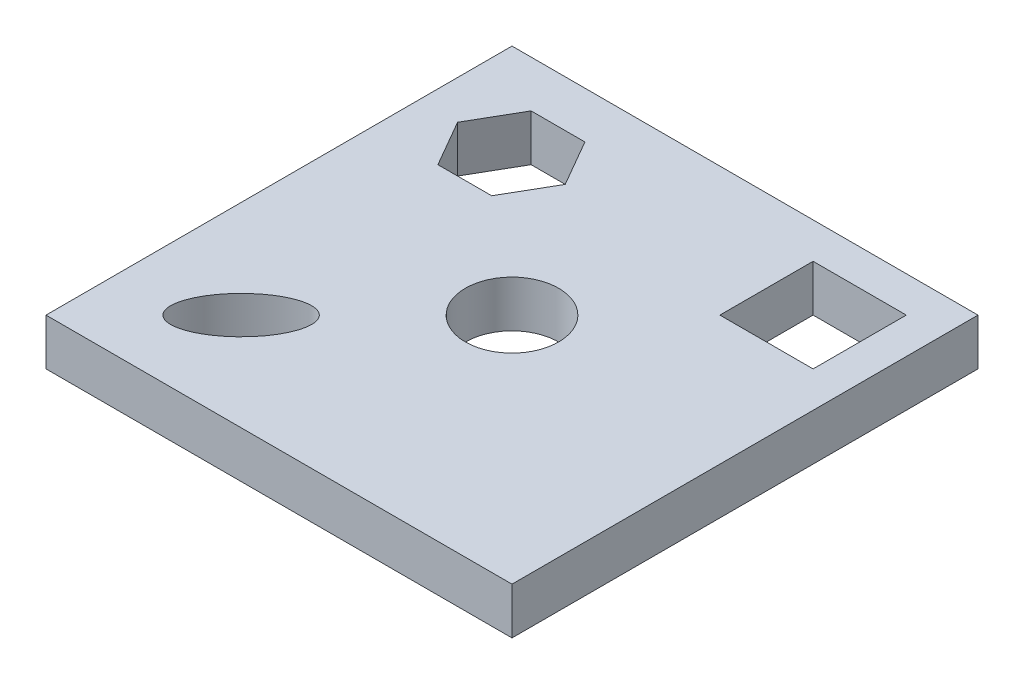
ISO-10303-21;
HEADER;
FILE_DESCRIPTION(('STEP AP214'),'2;1');
FILE_NAME('part.step','',(''),(''),'','','');
FILE_SCHEMA(('AUTOMOTIVE_DESIGN { 1 0 10303 214 1 1 1 1 }'));
ENDSEC;
DATA;
#1=APPLICATION_CONTEXT('core data for automotive mechanical design processes');
#2=APPLICATION_PROTOCOL_DEFINITION('international standard','automotive_design',2000,#1);
#3=PRODUCT_CONTEXT('',#1,'mechanical');
#4=PRODUCT('Part','Part','',(#3));
#5=PRODUCT_RELATED_PRODUCT_CATEGORY('part','',(#4));
#6=PRODUCT_DEFINITION_FORMATION('','',#4);
#7=PRODUCT_DEFINITION_CONTEXT('part definition',#1,'design');
#8=PRODUCT_DEFINITION('design','',#6,#7);
#9=PRODUCT_DEFINITION_SHAPE('','',#8);
#10=(LENGTH_UNIT() NAMED_UNIT(*) SI_UNIT(.MILLI.,.METRE.));
#11=(NAMED_UNIT(*) PLANE_ANGLE_UNIT() SI_UNIT($,.RADIAN.));
#12=(NAMED_UNIT(*) SI_UNIT($,.STERADIAN.) SOLID_ANGLE_UNIT());
#13=UNCERTAINTY_MEASURE_WITH_UNIT(LENGTH_MEASURE(1.E-05),#10,'distance_accuracy_value','');
#14=(GEOMETRIC_REPRESENTATION_CONTEXT(3) GLOBAL_UNCERTAINTY_ASSIGNED_CONTEXT((#13)) GLOBAL_UNIT_ASSIGNED_CONTEXT((#10,
#11,#12)) REPRESENTATION_CONTEXT('',''));
#15=CARTESIAN_POINT('',(0.,0.,0.));
#16=DIRECTION('',(0.,0.,1.));
#17=DIRECTION('',(1.,0.,0.));
#18=AXIS2_PLACEMENT_3D('',#15,#16,#17);
#19=CARTESIAN_POINT('',(0.,10.,0.));
#20=DIRECTION('',(0.,-1.,0.));
#21=DIRECTION('',(0.,0.,-1.));
#22=AXIS2_PLACEMENT_3D('',#19,#20,#21);
#23=PLANE('',#22);
#24=DIRECTION('',(0.499999999999999,0.,-0.866025403784439));
#25=VECTOR('',#24,1.);
#26=CARTESIAN_POINT('',(-24.3550675771164,10.,-20.));
#27=LINE('',#26,#25);
#28=CARTESIAN_POINT('',(-24.3550675771164,10.,-20.));
#29=VERTEX_POINT('',#28);
#30=CARTESIAN_POINT('',(-18.5815648852202,10.,-30.));
#31=VERTEX_POINT('',#30);
#32=EDGE_CURVE('E192',#29,#31,#27,.T.);
#33=ORIENTED_EDGE('',*,*,#32,.F.);
#34=DIRECTION('',(1.,0.,0.));
#35=VECTOR('',#34,1.);
#36=CARTESIAN_POINT('',(-35.9020729609089,10.,-20.));
#37=LINE('',#36,#35);
#38=CARTESIAN_POINT('',(-35.9020729609089,10.,-20.));
#39=VERTEX_POINT('',#38);
#40=EDGE_CURVE('E209',#39,#29,#37,.T.);
#41=ORIENTED_EDGE('',*,*,#40,.F.);
#42=DIRECTION('',(0.5,0.,0.866025403784438));
#43=VECTOR('',#42,1.);
#44=CARTESIAN_POINT('',(-41.6755756528052,10.,-30.));
#45=LINE('',#44,#43);
#46=CARTESIAN_POINT('',(-41.6755756528052,10.,-30.));
#47=VERTEX_POINT('',#46);
#48=EDGE_CURVE('E205',#47,#39,#45,.T.);
#49=ORIENTED_EDGE('',*,*,#48,.F.);
#50=DIRECTION('',(-0.5,0.,0.866025403784439));
#51=VECTOR('',#50,1.);
#52=CARTESIAN_POINT('',(-35.9020729609089,10.,-40.));
#53=LINE('',#52,#51);
#54=CARTESIAN_POINT('',(-35.9020729609089,10.,-40.));
#55=VERTEX_POINT('',#54);
#56=EDGE_CURVE('E202',#55,#47,#53,.T.);
#57=ORIENTED_EDGE('',*,*,#56,.F.);
#58=DIRECTION('',(-1.,0.,0.));
#59=VECTOR('',#58,1.);
#60=CARTESIAN_POINT('',(-24.3550675771164,10.,-40.));
#61=LINE('',#60,#59);
#62=CARTESIAN_POINT('',(-24.3550675771164,10.,-40.));
#63=VERTEX_POINT('',#62);
#64=EDGE_CURVE('E199',#63,#55,#61,.T.);
#65=ORIENTED_EDGE('',*,*,#64,.F.);
#66=DIRECTION('',(-0.5,0.,-0.866025403784438));
#67=VECTOR('',#66,1.);
#68=CARTESIAN_POINT('',(-18.5815648852202,10.,-30.));
#69=LINE('',#68,#67);
#70=EDGE_CURVE('E195',#31,#63,#69,.T.);
#71=ORIENTED_EDGE('',*,*,#70,.F.);
#72=EDGE_LOOP('',(#33,#41,#49,#57,#65,#71));
#73=FACE_BOUND('',#72,.T.);
#74=DIRECTION('',(0.,0.,-1.));
#75=VECTOR('',#74,1.);
#76=CARTESIAN_POINT('',(50.,10.,50.));
#77=LINE('',#76,#75);
#78=CARTESIAN_POINT('',(50.,10.,50.));
#79=VERTEX_POINT('',#78);
#80=CARTESIAN_POINT('',(50.,10.,-50.));
#81=VERTEX_POINT('',#80);
#82=EDGE_CURVE('E263',#79,#81,#77,.T.);
#83=ORIENTED_EDGE('',*,*,#82,.T.);
#84=DIRECTION('',(-1.,0.,0.));
#85=VECTOR('',#84,1.);
#86=CARTESIAN_POINT('',(-50.,10.,-50.));
#87=LINE('',#86,#85);
#88=CARTESIAN_POINT('',(-50.,10.,-50.));
#89=VERTEX_POINT('',#88);
#90=EDGE_CURVE('E267',#81,#89,#87,.T.);
#91=ORIENTED_EDGE('',*,*,#90,.T.);
#92=DIRECTION('',(0.,0.,1.));
#93=VECTOR('',#92,1.);
#94=CARTESIAN_POINT('',(-50.,10.,50.));
#95=LINE('',#94,#93);
#96=CARTESIAN_POINT('',(-50.,10.,50.));
#97=VERTEX_POINT('',#96);
#98=EDGE_CURVE('E271',#89,#97,#95,.T.);
#99=ORIENTED_EDGE('',*,*,#98,.T.);
#100=DIRECTION('',(1.,0.,0.));
#101=VECTOR('',#100,1.);
#102=CARTESIAN_POINT('',(-50.,10.,50.));
#103=LINE('',#102,#101);
#104=EDGE_CURVE('E274',#97,#79,#103,.T.);
#105=ORIENTED_EDGE('',*,*,#104,.T.);
#106=EDGE_LOOP('',(#83,#91,#99,#105));
#107=FACE_BOUND('',#106,.T.);
#108=CARTESIAN_POINT('',(0.,10.,0.));
#109=DIRECTION('',(0.,1.,0.));
#110=DIRECTION('',(0.,0.,1.));
#111=AXIS2_PLACEMENT_3D('',#108,#109,#110);
#112=CIRCLE('',#111,10.);
#113=CARTESIAN_POINT('',(0.,10.,10.));
#114=VERTEX_POINT('',#113);
#115=EDGE_CURVE('E255',#114,#114,#112,.T.);
#116=ORIENTED_EDGE('',*,*,#115,.F.);
#117=EDGE_LOOP('',(#116));
#118=FACE_BOUND('',#117,.T.);
#119=DIRECTION('',(0.,0.,-1.));
#120=VECTOR('',#119,1.);
#121=CARTESIAN_POINT('',(42.3058304418091,10.,-22.3058304418091));
#122=LINE('',#121,#120);
#123=CARTESIAN_POINT('',(42.3058304418091,10.,-22.3058304418091));
#124=VERTEX_POINT('',#123);
#125=CARTESIAN_POINT('',(42.3058304418091,10.,-42.3058304418091));
#126=VERTEX_POINT('',#125);
#127=EDGE_CURVE('E141',#124,#126,#122,.T.);
#128=ORIENTED_EDGE('',*,*,#127,.F.);
#129=DIRECTION('',(1.,0.,0.));
#130=VECTOR('',#129,1.);
#131=CARTESIAN_POINT('',(22.3058304418091,10.,-22.3058304418091));
#132=LINE('',#131,#130);
#133=CARTESIAN_POINT('',(22.3058304418091,10.,-22.3058304418091));
#134=VERTEX_POINT('',#133);
#135=EDGE_CURVE('E168',#134,#124,#132,.T.);
#136=ORIENTED_EDGE('',*,*,#135,.F.);
#137=DIRECTION('',(0.,0.,1.));
#138=VECTOR('',#137,1.);
#139=CARTESIAN_POINT('',(22.3058304418091,10.,-22.3058304418091));
#140=LINE('',#139,#138);
#141=CARTESIAN_POINT('',(22.3058304418091,10.,-42.3058304418091));
#142=VERTEX_POINT('',#141);
#143=EDGE_CURVE('E164',#142,#134,#140,.T.);
#144=ORIENTED_EDGE('',*,*,#143,.F.);
#145=DIRECTION('',(-1.,0.,0.));
#146=VECTOR('',#145,1.);
#147=CARTESIAN_POINT('',(22.3058304418091,10.,-42.3058304418091));
#148=LINE('',#147,#146);
#149=EDGE_CURVE('E150',#126,#142,#148,.T.);
#150=ORIENTED_EDGE('',*,*,#149,.F.);
#151=EDGE_LOOP('',(#128,#136,#144,#150));
#152=FACE_BOUND('',#151,.T.);
#153=CARTESIAN_POINT('',(-29.0650781796229,10.,29.065078179623));
#154=DIRECTION('',(0.,1.,0.));
#155=DIRECTION('',(0.707106781186548,0.,-0.707106781186547));
#156=AXIS2_PLACEMENT_3D('',#153,#154,#155);
#157=ELLIPSE('',#156,11.8671123244267,5.71715280038178);
#158=CARTESIAN_POINT('',(-20.6737625819184,10.,20.6737625819184));
#159=VERTEX_POINT('',#158);
#160=EDGE_CURVE('E176',#159,#159,#157,.T.);
#161=ORIENTED_EDGE('',*,*,#160,.F.);
#162=EDGE_LOOP('',(#161));
#163=FACE_BOUND('',#162,.T.);
#164=ADVANCED_FACE('F39',(#73,#107,#118,#152,#163),#23,.F.);
#165=CARTESIAN_POINT('',(0.,0.,0.));
#166=DIRECTION('',(0.,-1.,0.));
#167=DIRECTION('',(0.,0.,-1.));
#168=AXIS2_PLACEMENT_3D('',#165,#166,#167);
#169=PLANE('',#168);
#170=DIRECTION('',(1.,0.,0.));
#171=VECTOR('',#170,1.);
#172=CARTESIAN_POINT('',(22.3058304418091,0.,-22.3058304418091));
#173=LINE('',#172,#171);
#174=CARTESIAN_POINT('',(22.3058304418091,0.,-22.3058304418091));
#175=VERTEX_POINT('',#174);
#176=CARTESIAN_POINT('',(42.3058304418091,0.,-22.3058304418091));
#177=VERTEX_POINT('',#176);
#178=EDGE_CURVE('E151',#175,#177,#173,.T.);
#179=ORIENTED_EDGE('',*,*,#178,.T.);
#180=DIRECTION('',(0.,0.,-1.));
#181=VECTOR('',#180,1.);
#182=CARTESIAN_POINT('',(42.3058304418091,0.,-22.3058304418091));
#183=LINE('',#182,#181);
#184=CARTESIAN_POINT('',(42.3058304418091,0.,-42.3058304418091));
#185=VERTEX_POINT('',#184);
#186=EDGE_CURVE('E63',#177,#185,#183,.T.);
#187=ORIENTED_EDGE('',*,*,#186,.T.);
#188=DIRECTION('',(-1.,0.,0.));
#189=VECTOR('',#188,1.);
#190=CARTESIAN_POINT('',(22.3058304418091,0.,-42.3058304418091));
#191=LINE('',#190,#189);
#192=CARTESIAN_POINT('',(22.3058304418091,0.,-42.3058304418091));
#193=VERTEX_POINT('',#192);
#194=EDGE_CURVE('E157',#185,#193,#191,.T.);
#195=ORIENTED_EDGE('',*,*,#194,.T.);
#196=DIRECTION('',(0.,0.,1.));
#197=VECTOR('',#196,1.);
#198=CARTESIAN_POINT('',(22.3058304418091,0.,-22.3058304418091));
#199=LINE('',#198,#197);
#200=EDGE_CURVE('E179',#193,#175,#199,.T.);
#201=ORIENTED_EDGE('',*,*,#200,.T.);
#202=EDGE_LOOP('',(#179,#187,#195,#201));
#203=FACE_BOUND('',#202,.T.);
#204=DIRECTION('',(1.,0.,0.));
#205=VECTOR('',#204,1.);
#206=CARTESIAN_POINT('',(-35.9020729609089,0.,-20.));
#207=LINE('',#206,#205);
#208=CARTESIAN_POINT('',(-35.9020729609089,0.,-20.));
#209=VERTEX_POINT('',#208);
#210=CARTESIAN_POINT('',(-24.3550675771164,0.,-20.));
#211=VERTEX_POINT('',#210);
#212=EDGE_CURVE('E196',#209,#211,#207,.T.);
#213=ORIENTED_EDGE('',*,*,#212,.T.);
#214=DIRECTION('',(0.499999999999999,0.,-0.866025403784439));
#215=VECTOR('',#214,1.);
#216=CARTESIAN_POINT('',(-24.3550675771164,0.,-20.));
#217=LINE('',#216,#215);
#218=CARTESIAN_POINT('',(-18.5815648852202,0.,-30.));
#219=VERTEX_POINT('',#218);
#220=EDGE_CURVE('E159',#211,#219,#217,.T.);
#221=ORIENTED_EDGE('',*,*,#220,.T.);
#222=DIRECTION('',(-0.5,0.,-0.866025403784438));
#223=VECTOR('',#222,1.);
#224=CARTESIAN_POINT('',(-18.5815648852202,0.,-30.));
#225=LINE('',#224,#223);
#226=CARTESIAN_POINT('',(-24.3550675771164,0.,-40.));
#227=VERTEX_POINT('',#226);
#228=EDGE_CURVE('E216',#219,#227,#225,.T.);
#229=ORIENTED_EDGE('',*,*,#228,.T.);
#230=DIRECTION('',(-1.,0.,0.));
#231=VECTOR('',#230,1.);
#232=CARTESIAN_POINT('',(-24.3550675771164,0.,-40.));
#233=LINE('',#232,#231);
#234=CARTESIAN_POINT('',(-35.9020729609089,0.,-40.));
#235=VERTEX_POINT('',#234);
#236=EDGE_CURVE('E220',#227,#235,#233,.T.);
#237=ORIENTED_EDGE('',*,*,#236,.T.);
#238=DIRECTION('',(-0.5,0.,0.866025403784439));
#239=VECTOR('',#238,1.);
#240=CARTESIAN_POINT('',(-35.9020729609089,0.,-40.));
#241=LINE('',#240,#239);
#242=CARTESIAN_POINT('',(-41.6755756528052,0.,-30.));
#243=VERTEX_POINT('',#242);
#244=EDGE_CURVE('E224',#235,#243,#241,.T.);
#245=ORIENTED_EDGE('',*,*,#244,.T.);
#246=DIRECTION('',(0.5,0.,0.866025403784438));
#247=VECTOR('',#246,1.);
#248=CARTESIAN_POINT('',(-41.6755756528052,0.,-30.));
#249=LINE('',#248,#247);
#250=EDGE_CURVE('E228',#243,#209,#249,.T.);
#251=ORIENTED_EDGE('',*,*,#250,.T.);
#252=EDGE_LOOP('',(#213,#221,#229,#237,#245,#251));
#253=FACE_BOUND('',#252,.T.);
#254=CARTESIAN_POINT('',(0.,0.,0.));
#255=DIRECTION('',(0.,1.,0.));
#256=DIRECTION('',(0.,0.,1.));
#257=AXIS2_PLACEMENT_3D('',#254,#255,#256);
#258=CIRCLE('',#257,10.);
#259=CARTESIAN_POINT('',(0.,0.,10.));
#260=VERTEX_POINT('',#259);
#261=EDGE_CURVE('E254',#260,#260,#258,.T.);
#262=ORIENTED_EDGE('',*,*,#261,.T.);
#263=EDGE_LOOP('',(#262));
#264=FACE_BOUND('',#263,.T.);
#265=DIRECTION('',(0.,0.,-1.));
#266=VECTOR('',#265,1.);
#267=CARTESIAN_POINT('',(50.,0.,50.));
#268=LINE('',#267,#266);
#269=CARTESIAN_POINT('',(50.,0.,50.));
#270=VERTEX_POINT('',#269);
#271=CARTESIAN_POINT('',(50.,0.,-50.));
#272=VERTEX_POINT('',#271);
#273=EDGE_CURVE('E259',#270,#272,#268,.T.);
#274=ORIENTED_EDGE('',*,*,#273,.F.);
#275=DIRECTION('',(1.,0.,0.));
#276=VECTOR('',#275,1.);
#277=CARTESIAN_POINT('',(-50.,0.,50.));
#278=LINE('',#277,#276);
#279=CARTESIAN_POINT('',(-50.,0.,50.));
#280=VERTEX_POINT('',#279);
#281=EDGE_CURVE('E268',#280,#270,#278,.T.);
#282=ORIENTED_EDGE('',*,*,#281,.F.);
#283=DIRECTION('',(0.,0.,1.));
#284=VECTOR('',#283,1.);
#285=CARTESIAN_POINT('',(-50.,0.,50.));
#286=LINE('',#285,#284);
#287=CARTESIAN_POINT('',(-50.,0.,-50.));
#288=VERTEX_POINT('',#287);
#289=EDGE_CURVE('E284',#288,#280,#286,.T.);
#290=ORIENTED_EDGE('',*,*,#289,.F.);
#291=DIRECTION('',(-1.,0.,0.));
#292=VECTOR('',#291,1.);
#293=CARTESIAN_POINT('',(-50.,0.,-50.));
#294=LINE('',#293,#292);
#295=EDGE_CURVE('E281',#272,#288,#294,.T.);
#296=ORIENTED_EDGE('',*,*,#295,.F.);
#297=EDGE_LOOP('',(#274,#282,#290,#296));
#298=FACE_BOUND('',#297,.T.);
#299=CARTESIAN_POINT('',(-29.0650781796229,0.,29.065078179623));
#300=DIRECTION('',(0.,1.,0.));
#301=DIRECTION('',(0.707106781186548,0.,-0.707106781186547));
#302=AXIS2_PLACEMENT_3D('',#299,#300,#301);
#303=ELLIPSE('',#302,11.8671123244267,5.71715280038178);
#304=CARTESIAN_POINT('',(-20.6737625819184,0.,20.6737625819184));
#305=VERTEX_POINT('',#304);
#306=EDGE_CURVE('E393',#305,#305,#303,.T.);
#307=ORIENTED_EDGE('',*,*,#306,.T.);
#308=EDGE_LOOP('',(#307));
#309=FACE_BOUND('',#308,.T.);
#310=ADVANCED_FACE('F307',(#203,#253,#264,#298,#309),#169,.T.);
#311=CARTESIAN_POINT('',(50.,10.,50.));
#312=DIRECTION('',(-1.,0.,0.));
#313=DIRECTION('',(0.,0.,1.));
#314=AXIS2_PLACEMENT_3D('',#311,#312,#313);
#315=PLANE('',#314);
#316=ORIENTED_EDGE('',*,*,#273,.T.);
#317=DIRECTION('',(0.,-1.,0.));
#318=VECTOR('',#317,1.);
#319=CARTESIAN_POINT('',(50.,10.,-50.));
#320=LINE('',#319,#318);
#321=EDGE_CURVE('E11',#81,#272,#320,.T.);
#322=ORIENTED_EDGE('',*,*,#321,.F.);
#323=ORIENTED_EDGE('',*,*,#82,.F.);
#324=DIRECTION('',(0.,-1.,0.));
#325=VECTOR('',#324,1.);
#326=CARTESIAN_POINT('',(50.,10.,50.));
#327=LINE('',#326,#325);
#328=EDGE_CURVE('E277',#79,#270,#327,.T.);
#329=ORIENTED_EDGE('',*,*,#328,.T.);
#330=EDGE_LOOP('',(#316,#322,#323,#329));
#331=FACE_BOUND('',#330,.T.);
#332=ADVANCED_FACE('F41',(#331),#315,.F.);
#333=CARTESIAN_POINT('',(-50.,10.,-50.));
#334=DIRECTION('',(0.,0.,1.));
#335=DIRECTION('',(1.,0.,0.));
#336=AXIS2_PLACEMENT_3D('',#333,#334,#335);
#337=PLANE('',#336);
#338=ORIENTED_EDGE('',*,*,#295,.T.);
#339=DIRECTION('',(0.,-1.,0.));
#340=VECTOR('',#339,1.);
#341=CARTESIAN_POINT('',(-50.,10.,-50.));
#342=LINE('',#341,#340);
#343=EDGE_CURVE('E48',#89,#288,#342,.T.);
#344=ORIENTED_EDGE('',*,*,#343,.F.);
#345=ORIENTED_EDGE('',*,*,#90,.F.);
#346=ORIENTED_EDGE('',*,*,#321,.T.);
#347=EDGE_LOOP('',(#338,#344,#345,#346));
#348=FACE_BOUND('',#347,.T.);
#349=ADVANCED_FACE('F318',(#348),#337,.F.);
#350=CARTESIAN_POINT('',(-50.,10.,50.));
#351=DIRECTION('',(1.,0.,0.));
#352=DIRECTION('',(0.,0.,-1.));
#353=AXIS2_PLACEMENT_3D('',#350,#351,#352);
#354=PLANE('',#353);
#355=ORIENTED_EDGE('',*,*,#289,.T.);
#356=DIRECTION('',(0.,-1.,0.));
#357=VECTOR('',#356,1.);
#358=CARTESIAN_POINT('',(-50.,10.,50.));
#359=LINE('',#358,#357);
#360=EDGE_CURVE('E292',#97,#280,#359,.T.);
#361=ORIENTED_EDGE('',*,*,#360,.F.);
#362=ORIENTED_EDGE('',*,*,#98,.F.);
#363=ORIENTED_EDGE('',*,*,#343,.T.);
#364=EDGE_LOOP('',(#355,#361,#362,#363));
#365=FACE_BOUND('',#364,.T.);
#366=ADVANCED_FACE('F301',(#365),#354,.F.);
#367=CARTESIAN_POINT('',(-50.,10.,50.));
#368=DIRECTION('',(0.,0.,-1.));
#369=DIRECTION('',(-1.,0.,0.));
#370=AXIS2_PLACEMENT_3D('',#367,#368,#369);
#371=PLANE('',#370);
#372=ORIENTED_EDGE('',*,*,#281,.T.);
#373=ORIENTED_EDGE('',*,*,#328,.F.);
#374=ORIENTED_EDGE('',*,*,#104,.F.);
#375=ORIENTED_EDGE('',*,*,#360,.T.);
#376=EDGE_LOOP('',(#372,#373,#374,#375));
#377=FACE_BOUND('',#376,.T.);
#378=ADVANCED_FACE('F311',(#377),#371,.F.);
#379=CARTESIAN_POINT('',(0.,10.,0.));
#380=DIRECTION('',(0.,-1.,0.));
#381=DIRECTION('',(0.,0.,-1.));
#382=AXIS2_PLACEMENT_3D('',#379,#380,#381);
#383=CYLINDRICAL_SURFACE('',#382,10.);
#384=ORIENTED_EDGE('',*,*,#115,.T.);
#385=EDGE_LOOP('',(#384));
#386=FACE_BOUND('',#385,.T.);
#387=ORIENTED_EDGE('',*,*,#261,.F.);
#388=EDGE_LOOP('',(#387));
#389=FACE_BOUND('',#388,.T.);
#390=ADVANCED_FACE('F335',(#386,#389),#383,.F.);
#391=CARTESIAN_POINT('',(-24.3550675771164,10.,-20.));
#392=DIRECTION('',(-0.866025403784439,0.,-0.499999999999999));
#393=DIRECTION('',(-0.499999999999999,0.,0.866025403784439));
#394=AXIS2_PLACEMENT_3D('',#391,#392,#393);
#395=PLANE('',#394);
#396=ORIENTED_EDGE('',*,*,#220,.F.);
#397=DIRECTION('',(0.,-1.,0.));
#398=VECTOR('',#397,1.);
#399=CARTESIAN_POINT('',(-24.3550675771164,10.,-20.));
#400=LINE('',#399,#398);
#401=EDGE_CURVE('E212',#29,#211,#400,.T.);
#402=ORIENTED_EDGE('',*,*,#401,.F.);
#403=ORIENTED_EDGE('',*,*,#32,.T.);
#404=DIRECTION('',(0.,-1.,0.));
#405=VECTOR('',#404,1.);
#406=CARTESIAN_POINT('',(-18.5815648852202,10.,-30.));
#407=LINE('',#406,#405);
#408=EDGE_CURVE('E250',#31,#219,#407,.T.);
#409=ORIENTED_EDGE('',*,*,#408,.T.);
#410=EDGE_LOOP('',(#396,#402,#403,#409));
#411=FACE_BOUND('',#410,.T.);
#412=ADVANCED_FACE('F342',(#411),#395,.T.);
#413=CARTESIAN_POINT('',(-18.5815648852202,10.,-30.));
#414=DIRECTION('',(-0.866025403784438,0.,0.5));
#415=DIRECTION('',(0.5,0.,0.866025403784438));
#416=AXIS2_PLACEMENT_3D('',#413,#414,#415);
#417=PLANE('',#416);
#418=ORIENTED_EDGE('',*,*,#228,.F.);
#419=ORIENTED_EDGE('',*,*,#408,.F.);
#420=ORIENTED_EDGE('',*,*,#70,.T.);
#421=DIRECTION('',(0.,-1.,0.));
#422=VECTOR('',#421,1.);
#423=CARTESIAN_POINT('',(-24.3550675771164,10.,-40.));
#424=LINE('',#423,#422);
#425=EDGE_CURVE('E247',#63,#227,#424,.T.);
#426=ORIENTED_EDGE('',*,*,#425,.T.);
#427=EDGE_LOOP('',(#418,#419,#420,#426));
#428=FACE_BOUND('',#427,.T.);
#429=ADVANCED_FACE('F347',(#428),#417,.T.);
#430=CARTESIAN_POINT('',(-24.3550675771164,10.,-40.));
#431=DIRECTION('',(0.,0.,1.));
#432=DIRECTION('',(1.,0.,0.));
#433=AXIS2_PLACEMENT_3D('',#430,#431,#432);
#434=PLANE('',#433);
#435=ORIENTED_EDGE('',*,*,#236,.F.);
#436=ORIENTED_EDGE('',*,*,#425,.F.);
#437=ORIENTED_EDGE('',*,*,#64,.T.);
#438=DIRECTION('',(0.,-1.,0.));
#439=VECTOR('',#438,1.);
#440=CARTESIAN_POINT('',(-35.9020729609089,10.,-40.));
#441=LINE('',#440,#439);
#442=EDGE_CURVE('E244',#55,#235,#441,.T.);
#443=ORIENTED_EDGE('',*,*,#442,.T.);
#444=EDGE_LOOP('',(#435,#436,#437,#443));
#445=FACE_BOUND('',#444,.T.);
#446=ADVANCED_FACE('F356',(#445),#434,.T.);
#447=CARTESIAN_POINT('',(-35.9020729609089,10.,-40.));
#448=DIRECTION('',(0.866025403784439,0.,0.5));
#449=DIRECTION('',(0.5,0.,-0.866025403784439));
#450=AXIS2_PLACEMENT_3D('',#447,#448,#449);
#451=PLANE('',#450);
#452=ORIENTED_EDGE('',*,*,#244,.F.);
#453=ORIENTED_EDGE('',*,*,#442,.F.);
#454=ORIENTED_EDGE('',*,*,#56,.T.);
#455=DIRECTION('',(0.,-1.,0.));
#456=VECTOR('',#455,1.);
#457=CARTESIAN_POINT('',(-41.6755756528052,10.,-30.));
#458=LINE('',#457,#456);
#459=EDGE_CURVE('E241',#47,#243,#458,.T.);
#460=ORIENTED_EDGE('',*,*,#459,.T.);
#461=EDGE_LOOP('',(#452,#453,#454,#460));
#462=FACE_BOUND('',#461,.T.);
#463=ADVANCED_FACE('F362',(#462),#451,.T.);
#464=CARTESIAN_POINT('',(-41.6755756528052,10.,-30.));
#465=DIRECTION('',(0.866025403784438,0.,-0.5));
#466=DIRECTION('',(-0.5,0.,-0.866025403784438));
#467=AXIS2_PLACEMENT_3D('',#464,#465,#466);
#468=PLANE('',#467);
#469=ORIENTED_EDGE('',*,*,#250,.F.);
#470=ORIENTED_EDGE('',*,*,#459,.F.);
#471=ORIENTED_EDGE('',*,*,#48,.T.);
#472=DIRECTION('',(0.,-1.,0.));
#473=VECTOR('',#472,1.);
#474=CARTESIAN_POINT('',(-35.9020729609089,10.,-20.));
#475=LINE('',#474,#473);
#476=EDGE_CURVE('E238',#39,#209,#475,.T.);
#477=ORIENTED_EDGE('',*,*,#476,.T.);
#478=EDGE_LOOP('',(#469,#470,#471,#477));
#479=FACE_BOUND('',#478,.T.);
#480=ADVANCED_FACE('F366',(#479),#468,.T.);
#481=CARTESIAN_POINT('',(-35.9020729609089,10.,-20.));
#482=DIRECTION('',(0.,0.,-1.));
#483=DIRECTION('',(-1.,0.,0.));
#484=AXIS2_PLACEMENT_3D('',#481,#482,#483);
#485=PLANE('',#484);
#486=ORIENTED_EDGE('',*,*,#212,.F.);
#487=ORIENTED_EDGE('',*,*,#476,.F.);
#488=ORIENTED_EDGE('',*,*,#40,.T.);
#489=ORIENTED_EDGE('',*,*,#401,.T.);
#490=EDGE_LOOP('',(#486,#487,#488,#489));
#491=FACE_BOUND('',#490,.T.);
#492=ADVANCED_FACE('F370',(#491),#485,.T.);
#493=CARTESIAN_POINT('',(42.3058304418091,10.,-22.3058304418091));
#494=DIRECTION('',(-1.,0.,0.));
#495=DIRECTION('',(0.,0.,1.));
#496=AXIS2_PLACEMENT_3D('',#493,#494,#495);
#497=PLANE('',#496);
#498=ORIENTED_EDGE('',*,*,#186,.F.);
#499=DIRECTION('',(0.,-1.,0.));
#500=VECTOR('',#499,1.);
#501=CARTESIAN_POINT('',(42.3058304418091,10.,-22.3058304418091));
#502=LINE('',#501,#500);
#503=EDGE_CURVE('E145',#124,#177,#502,.T.);
#504=ORIENTED_EDGE('',*,*,#503,.F.);
#505=ORIENTED_EDGE('',*,*,#127,.T.);
#506=DIRECTION('',(0.,-1.,0.));
#507=VECTOR('',#506,1.);
#508=CARTESIAN_POINT('',(42.3058304418091,10.,-42.3058304418091));
#509=LINE('',#508,#507);
#510=EDGE_CURVE('E144',#126,#185,#509,.T.);
#511=ORIENTED_EDGE('',*,*,#510,.T.);
#512=EDGE_LOOP('',(#498,#504,#505,#511));
#513=FACE_BOUND('',#512,.T.);
#514=ADVANCED_FACE('F143',(#513),#497,.T.);
#515=CARTESIAN_POINT('',(22.3058304418091,10.,-42.3058304418091));
#516=DIRECTION('',(0.,0.,1.));
#517=DIRECTION('',(1.,0.,0.));
#518=AXIS2_PLACEMENT_3D('',#515,#516,#517);
#519=PLANE('',#518);
#520=ORIENTED_EDGE('',*,*,#194,.F.);
#521=ORIENTED_EDGE('',*,*,#510,.F.);
#522=ORIENTED_EDGE('',*,*,#149,.T.);
#523=DIRECTION('',(0.,-1.,0.));
#524=VECTOR('',#523,1.);
#525=CARTESIAN_POINT('',(22.3058304418091,10.,-42.3058304418091));
#526=LINE('',#525,#524);
#527=EDGE_CURVE('E160',#142,#193,#526,.T.);
#528=ORIENTED_EDGE('',*,*,#527,.T.);
#529=EDGE_LOOP('',(#520,#521,#522,#528));
#530=FACE_BOUND('',#529,.T.);
#531=ADVANCED_FACE('F154',(#530),#519,.T.);
#532=CARTESIAN_POINT('',(22.3058304418091,10.,-22.3058304418091));
#533=DIRECTION('',(1.,0.,0.));
#534=DIRECTION('',(0.,0.,-1.));
#535=AXIS2_PLACEMENT_3D('',#532,#533,#534);
#536=PLANE('',#535);
#537=ORIENTED_EDGE('',*,*,#200,.F.);
#538=ORIENTED_EDGE('',*,*,#527,.F.);
#539=ORIENTED_EDGE('',*,*,#143,.T.);
#540=DIRECTION('',(0.,-1.,0.));
#541=VECTOR('',#540,1.);
#542=CARTESIAN_POINT('',(22.3058304418091,10.,-22.3058304418091));
#543=LINE('',#542,#541);
#544=EDGE_CURVE('E55',#134,#175,#543,.T.);
#545=ORIENTED_EDGE('',*,*,#544,.T.);
#546=EDGE_LOOP('',(#537,#538,#539,#545));
#547=FACE_BOUND('',#546,.T.);
#548=ADVANCED_FACE('F379',(#547),#536,.T.);
#549=CARTESIAN_POINT('',(22.3058304418091,10.,-22.3058304418091));
#550=DIRECTION('',(0.,0.,-1.));
#551=DIRECTION('',(-1.,0.,0.));
#552=AXIS2_PLACEMENT_3D('',#549,#550,#551);
#553=PLANE('',#552);
#554=ORIENTED_EDGE('',*,*,#178,.F.);
#555=ORIENTED_EDGE('',*,*,#544,.F.);
#556=ORIENTED_EDGE('',*,*,#135,.T.);
#557=ORIENTED_EDGE('',*,*,#503,.T.);
#558=EDGE_LOOP('',(#554,#555,#556,#557));
#559=FACE_BOUND('',#558,.T.);
#560=ADVANCED_FACE('F382',(#559),#553,.T.);
#561=DIRECTION('',(0.,-1.,0.));
#562=VECTOR('',#561,1.);
#563=SURFACE_OF_LINEAR_EXTRUSION('',#157,#562);
#564=ORIENTED_EDGE('',*,*,#160,.T.);
#565=EDGE_LOOP('',(#564));
#566=FACE_BOUND('',#565,.T.);
#567=ORIENTED_EDGE('',*,*,#306,.F.);
#568=EDGE_LOOP('',(#567));
#569=FACE_BOUND('',#568,.T.);
#570=ADVANCED_FACE('F386',(#566,#569),#563,.T.);
#571=CLOSED_SHELL('',(#164,#310,#332,#349,#366,#378,#390,#412,#429,#446,#463,#480,#492,#514,
#531,#548,#560,#570));
#572=MANIFOLD_SOLID_BREP('B2',#571);
#573=ADVANCED_BREP_SHAPE_REPRESENTATION('',(#18,#572),#14);
#574=SHAPE_DEFINITION_REPRESENTATION(#9,#573);
ENDSEC;
END-ISO-10303-21;
